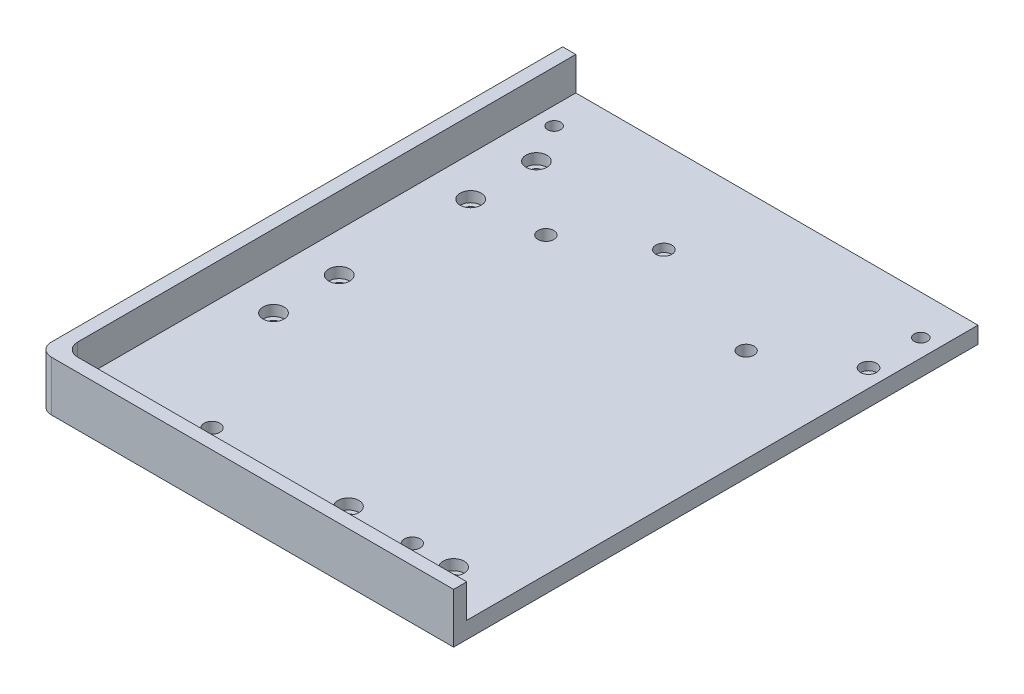
ISO-10303-21;
HEADER;
FILE_DESCRIPTION(('STEP AP214'),'2;1');
FILE_NAME('part.step','',(''),(''),'','','');
FILE_SCHEMA(('AUTOMOTIVE_DESIGN { 1 0 10303 214 1 1 1 1 }'));
ENDSEC;
DATA;
#1=APPLICATION_CONTEXT('core data for automotive mechanical design processes');
#2=APPLICATION_PROTOCOL_DEFINITION('international standard','automotive_design',2000,#1);
#3=PRODUCT_CONTEXT('',#1,'mechanical');
#4=PRODUCT('Part','Part','',(#3));
#5=PRODUCT_RELATED_PRODUCT_CATEGORY('part','',(#4));
#6=PRODUCT_DEFINITION_FORMATION('','',#4);
#7=PRODUCT_DEFINITION_CONTEXT('part definition',#1,'design');
#8=PRODUCT_DEFINITION('design','',#6,#7);
#9=PRODUCT_DEFINITION_SHAPE('','',#8);
#10=(LENGTH_UNIT() NAMED_UNIT(*) SI_UNIT(.MILLI.,.METRE.));
#11=(NAMED_UNIT(*) PLANE_ANGLE_UNIT() SI_UNIT($,.RADIAN.));
#12=(NAMED_UNIT(*) SI_UNIT($,.STERADIAN.) SOLID_ANGLE_UNIT());
#13=UNCERTAINTY_MEASURE_WITH_UNIT(LENGTH_MEASURE(1.E-05),#10,'distance_accuracy_value','');
#14=(GEOMETRIC_REPRESENTATION_CONTEXT(3) GLOBAL_UNCERTAINTY_ASSIGNED_CONTEXT((#13)) GLOBAL_UNIT_ASSIGNED_CONTEXT((#10,
#11,#12)) REPRESENTATION_CONTEXT('',''));
#15=CARTESIAN_POINT('',(0.,0.,0.));
#16=DIRECTION('',(0.,0.,1.));
#17=DIRECTION('',(1.,0.,0.));
#18=AXIS2_PLACEMENT_3D('',#15,#16,#17);
#19=CARTESIAN_POINT('',(0.,6.35,0.));
#20=DIRECTION('',(1.,0.,0.));
#21=DIRECTION('',(0.,0.,-1.));
#22=AXIS2_PLACEMENT_3D('',#19,#20,#21);
#23=PLANE('',#22);
#24=DIRECTION('',(0.,0.,1.));
#25=VECTOR('',#24,1.);
#26=CARTESIAN_POINT('',(0.,0.,0.));
#27=LINE('',#26,#25);
#28=CARTESIAN_POINT('',(0.,0.,0.));
#29=VERTEX_POINT('',#28);
#30=CARTESIAN_POINT('',(0.,0.,194.5));
#31=VERTEX_POINT('',#30);
#32=EDGE_CURVE('E172',#29,#31,#27,.T.);
#33=ORIENTED_EDGE('',*,*,#32,.T.);
#34=DIRECTION('',(0.,-1.,0.));
#35=VECTOR('',#34,1.);
#36=CARTESIAN_POINT('',(0.,6.35,194.5));
#37=LINE('',#36,#35);
#38=CARTESIAN_POINT('',(0.,19.05,194.5));
#39=VERTEX_POINT('',#38);
#40=EDGE_CURVE('E62',#31,#39,#37,.F.);
#41=ORIENTED_EDGE('',*,*,#40,.T.);
#42=DIRECTION('',(0.,0.,1.));
#43=VECTOR('',#42,1.);
#44=CARTESIAN_POINT('',(0.,19.05,0.));
#45=LINE('',#44,#43);
#46=CARTESIAN_POINT('',(0.,19.05,0.));
#47=VERTEX_POINT('',#46);
#48=EDGE_CURVE('E131',#47,#39,#45,.T.);
#49=ORIENTED_EDGE('',*,*,#48,.F.);
#50=DIRECTION('',(0.,-1.,0.));
#51=VECTOR('',#50,1.);
#52=CARTESIAN_POINT('',(0.,6.35,0.));
#53=LINE('',#52,#51);
#54=EDGE_CURVE('E119',#47,#29,#53,.T.);
#55=ORIENTED_EDGE('',*,*,#54,.T.);
#56=EDGE_LOOP('',(#33,#41,#49,#55));
#57=FACE_BOUND('',#56,.T.);
#58=ADVANCED_FACE('F46',(#57),#23,.F.);
#59=CARTESIAN_POINT('',(0.,6.35,199.5));
#60=DIRECTION('',(0.,0.,-1.));
#61=DIRECTION('',(-1.,0.,0.));
#62=AXIS2_PLACEMENT_3D('',#59,#60,#61);
#63=PLANE('',#62);
#64=DIRECTION('',(1.,0.,0.));
#65=VECTOR('',#64,1.);
#66=CARTESIAN_POINT('',(0.,19.05,199.5));
#67=LINE('',#66,#65);
#68=CARTESIAN_POINT('',(5.00000000000005,19.05,199.5));
#69=VERTEX_POINT('',#68);
#70=CARTESIAN_POINT('',(158.,19.05,199.5));
#71=VERTEX_POINT('',#70);
#72=EDGE_CURVE('E135',#69,#71,#67,.T.);
#73=ORIENTED_EDGE('',*,*,#72,.F.);
#74=DIRECTION('',(0.,-1.,0.));
#75=VECTOR('',#74,1.);
#76=CARTESIAN_POINT('',(5.00000000000005,6.35,199.5));
#77=LINE('',#76,#75);
#78=CARTESIAN_POINT('',(5.00000000000005,0.,199.5));
#79=VERTEX_POINT('',#78);
#80=EDGE_CURVE('E205',#69,#79,#77,.T.);
#81=ORIENTED_EDGE('',*,*,#80,.T.);
#82=DIRECTION('',(1.,0.,0.));
#83=VECTOR('',#82,1.);
#84=CARTESIAN_POINT('',(0.,0.,199.5));
#85=LINE('',#84,#83);
#86=CARTESIAN_POINT('',(158.,0.,199.5));
#87=VERTEX_POINT('',#86);
#88=EDGE_CURVE('E181',#79,#87,#85,.T.);
#89=ORIENTED_EDGE('',*,*,#88,.T.);
#90=DIRECTION('',(0.,-1.,0.));
#91=VECTOR('',#90,1.);
#92=CARTESIAN_POINT('',(158.,6.35,199.5));
#93=LINE('',#92,#91);
#94=EDGE_CURVE('E191',#71,#87,#93,.T.);
#95=ORIENTED_EDGE('',*,*,#94,.F.);
#96=EDGE_LOOP('',(#73,#81,#89,#95));
#97=FACE_BOUND('',#96,.T.);
#98=ADVANCED_FACE('F218',(#97),#63,.F.);
#99=CARTESIAN_POINT('',(158.,6.35,0.));
#100=DIRECTION('',(-1.,0.,0.));
#101=DIRECTION('',(0.,0.,1.));
#102=AXIS2_PLACEMENT_3D('',#99,#100,#101);
#103=PLANE('',#102);
#104=DIRECTION('',(0.,0.,-1.));
#105=VECTOR('',#104,1.);
#106=CARTESIAN_POINT('',(158.,0.,0.));
#107=LINE('',#106,#105);
#108=CARTESIAN_POINT('',(158.,0.,0.));
#109=VERTEX_POINT('',#108);
#110=EDGE_CURVE('E184',#87,#109,#107,.T.);
#111=ORIENTED_EDGE('',*,*,#110,.T.);
#112=DIRECTION('',(0.,-1.,0.));
#113=VECTOR('',#112,1.);
#114=CARTESIAN_POINT('',(158.,6.35,0.));
#115=LINE('',#114,#113);
#116=CARTESIAN_POINT('',(158.,6.35,0.));
#117=VERTEX_POINT('',#116);
#118=EDGE_CURVE('E128',#117,#109,#115,.T.);
#119=ORIENTED_EDGE('',*,*,#118,.F.);
#120=DIRECTION('',(0.,0.,-1.));
#121=VECTOR('',#120,1.);
#122=CARTESIAN_POINT('',(158.,6.35,0.));
#123=LINE('',#122,#121);
#124=CARTESIAN_POINT('',(158.,6.35,194.5));
#125=VERTEX_POINT('',#124);
#126=EDGE_CURVE('E173',#125,#117,#123,.T.);
#127=ORIENTED_EDGE('',*,*,#126,.F.);
#128=DIRECTION('',(0.,-1.,0.));
#129=VECTOR('',#128,1.);
#130=CARTESIAN_POINT('',(158.,19.05,194.5));
#131=LINE('',#130,#129);
#132=CARTESIAN_POINT('',(158.,19.05,194.5));
#133=VERTEX_POINT('',#132);
#134=EDGE_CURVE('E168',#133,#125,#131,.T.);
#135=ORIENTED_EDGE('',*,*,#134,.F.);
#136=DIRECTION('',(0.,0.,-1.));
#137=VECTOR('',#136,1.);
#138=CARTESIAN_POINT('',(158.,19.05,199.5));
#139=LINE('',#138,#137);
#140=EDGE_CURVE('E153',#71,#133,#139,.T.);
#141=ORIENTED_EDGE('',*,*,#140,.F.);
#142=ORIENTED_EDGE('',*,*,#94,.T.);
#143=EDGE_LOOP('',(#111,#119,#127,#135,#141,#142));
#144=FACE_BOUND('',#143,.T.);
#145=ADVANCED_FACE('F238',(#144),#103,.F.);
#146=CARTESIAN_POINT('',(0.,6.35,0.));
#147=DIRECTION('',(0.,0.,1.));
#148=DIRECTION('',(1.,0.,0.));
#149=AXIS2_PLACEMENT_3D('',#146,#147,#148);
#150=PLANE('',#149);
#151=DIRECTION('',(-1.,0.,0.));
#152=VECTOR('',#151,1.);
#153=CARTESIAN_POINT('',(0.,0.,0.));
#154=LINE('',#153,#152);
#155=EDGE_CURVE('E126',#109,#29,#154,.T.);
#156=ORIENTED_EDGE('',*,*,#155,.T.);
#157=ORIENTED_EDGE('',*,*,#54,.F.);
#158=DIRECTION('',(-1.,0.,0.));
#159=VECTOR('',#158,1.);
#160=CARTESIAN_POINT('',(0.,19.05,0.));
#161=LINE('',#160,#159);
#162=CARTESIAN_POINT('',(5.,19.05,0.));
#163=VERTEX_POINT('',#162);
#164=EDGE_CURVE('E123',#163,#47,#161,.T.);
#165=ORIENTED_EDGE('',*,*,#164,.F.);
#166=DIRECTION('',(0.,-1.,0.));
#167=VECTOR('',#166,1.);
#168=CARTESIAN_POINT('',(5.,19.05,0.));
#169=LINE('',#168,#167);
#170=CARTESIAN_POINT('',(5.,6.35,0.));
#171=VERTEX_POINT('',#170);
#172=EDGE_CURVE('E162',#163,#171,#169,.T.);
#173=ORIENTED_EDGE('',*,*,#172,.T.);
#174=DIRECTION('',(-1.,0.,0.));
#175=VECTOR('',#174,1.);
#176=CARTESIAN_POINT('',(0.,6.35,0.));
#177=LINE('',#176,#175);
#178=EDGE_CURVE('E129',#117,#171,#177,.T.);
#179=ORIENTED_EDGE('',*,*,#178,.F.);
#180=ORIENTED_EDGE('',*,*,#118,.T.);
#181=EDGE_LOOP('',(#156,#157,#165,#173,#179,#180));
#182=FACE_BOUND('',#181,.T.);
#183=ADVANCED_FACE('F120',(#182),#150,.F.);
#184=CARTESIAN_POINT('',(0.,6.35,0.));
#185=DIRECTION('',(0.,1.,0.));
#186=DIRECTION('',(0.,0.,1.));
#187=AXIS2_PLACEMENT_3D('',#184,#185,#186);
#188=PLANE('',#187);
#189=CARTESIAN_POINT('',(151.25,6.35,34.9));
#190=DIRECTION('',(0.,1.,0.));
#191=DIRECTION('',(0.,0.,1.));
#192=AXIS2_PLACEMENT_3D('',#189,#190,#191);
#193=CIRCLE('',#192,3.04999999999999);
#194=CARTESIAN_POINT('',(151.25,6.35,37.95));
#195=VERTEX_POINT('',#194);
#196=EDGE_CURVE('E375',#195,#195,#193,.T.);
#197=ORIENTED_EDGE('',*,*,#196,.F.);
#198=EDGE_LOOP('',(#197));
#199=FACE_BOUND('',#198,.T.);
#200=CARTESIAN_POINT('',(73.375,6.35,34.9));
#201=DIRECTION('',(0.,1.,0.));
#202=DIRECTION('',(0.,0.,1.));
#203=AXIS2_PLACEMENT_3D('',#200,#201,#202);
#204=CIRCLE('',#203,3.04999999999999);
#205=CARTESIAN_POINT('',(73.375,6.35,37.95));
#206=VERTEX_POINT('',#205);
#207=EDGE_CURVE('E383',#206,#206,#204,.T.);
#208=ORIENTED_EDGE('',*,*,#207,.F.);
#209=EDGE_LOOP('',(#208));
#210=FACE_BOUND('',#209,.T.);
#211=CARTESIAN_POINT('',(11.75,6.35,15.));
#212=DIRECTION('',(0.,1.,0.));
#213=DIRECTION('',(0.,0.,1.));
#214=AXIS2_PLACEMENT_3D('',#211,#212,#213);
#215=CIRCLE('',#214,2.5);
#216=CARTESIAN_POINT('',(11.75,6.35,17.5));
#217=VERTEX_POINT('',#216);
#218=EDGE_CURVE('E398',#217,#217,#215,.T.);
#219=ORIENTED_EDGE('',*,*,#218,.F.);
#220=EDGE_LOOP('',(#219));
#221=FACE_BOUND('',#220,.T.);
#222=CARTESIAN_POINT('',(151.25,6.35,15.));
#223=DIRECTION('',(0.,1.,0.));
#224=DIRECTION('',(0.,0.,1.));
#225=AXIS2_PLACEMENT_3D('',#222,#223,#224);
#226=CIRCLE('',#225,2.5);
#227=CARTESIAN_POINT('',(151.25,6.35,17.5));
#228=VERTEX_POINT('',#227);
#229=EDGE_CURVE('E380',#228,#228,#226,.T.);
#230=ORIENTED_EDGE('',*,*,#229,.F.);
#231=EDGE_LOOP('',(#230));
#232=FACE_BOUND('',#231,.T.);
#233=CARTESIAN_POINT('',(46.1,6.35,179.5));
#234=DIRECTION('',(0.,1.,0.));
#235=DIRECTION('',(0.,0.,1.));
#236=AXIS2_PLACEMENT_3D('',#233,#234,#235);
#237=CIRCLE('',#236,3.00000000000001);
#238=CARTESIAN_POINT('',(46.1,6.35,182.5));
#239=VERTEX_POINT('',#238);
#240=EDGE_CURVE('E422',#239,#239,#237,.T.);
#241=ORIENTED_EDGE('',*,*,#240,.F.);
#242=EDGE_LOOP('',(#241));
#243=FACE_BOUND('',#242,.T.);
#244=CARTESIAN_POINT('',(122.3,6.35,179.5));
#245=DIRECTION('',(0.,1.,0.));
#246=DIRECTION('',(0.,0.,1.));
#247=AXIS2_PLACEMENT_3D('',#244,#245,#246);
#248=CIRCLE('',#247,2.99999999999991);
#249=CARTESIAN_POINT('',(122.3,6.35,182.5));
#250=VERTEX_POINT('',#249);
#251=EDGE_CURVE('E414',#250,#250,#248,.T.);
#252=ORIENTED_EDGE('',*,*,#251,.F.);
#253=EDGE_LOOP('',(#252));
#254=FACE_BOUND('',#253,.T.);
#255=CARTESIAN_POINT('',(122.3,6.35,52.5));
#256=DIRECTION('',(0.,1.,0.));
#257=DIRECTION('',(0.,0.,1.));
#258=AXIS2_PLACEMENT_3D('',#255,#256,#257);
#259=CIRCLE('',#258,2.99999999999991);
#260=CARTESIAN_POINT('',(122.3,6.35,55.4999999999999));
#261=VERTEX_POINT('',#260);
#262=EDGE_CURVE('E405',#261,#261,#259,.T.);
#263=ORIENTED_EDGE('',*,*,#262,.F.);
#264=EDGE_LOOP('',(#263));
#265=FACE_BOUND('',#264,.T.);
#266=CARTESIAN_POINT('',(46.1,6.35,52.5));
#267=DIRECTION('',(0.,1.,0.));
#268=DIRECTION('',(0.,0.,1.));
#269=AXIS2_PLACEMENT_3D('',#266,#267,#268);
#270=CIRCLE('',#269,3.00000000000001);
#271=CARTESIAN_POINT('',(46.1,6.35,55.5));
#272=VERTEX_POINT('',#271);
#273=EDGE_CURVE('E409',#272,#272,#270,.T.);
#274=ORIENTED_EDGE('',*,*,#273,.F.);
#275=EDGE_LOOP('',(#274));
#276=FACE_BOUND('',#275,.T.);
#277=CARTESIAN_POINT('',(98.,6.35,179.5));
#278=DIRECTION('',(0.,1.,0.));
#279=DIRECTION('',(0.,0.,1.));
#280=AXIS2_PLACEMENT_3D('',#277,#278,#279);
#281=CIRCLE('',#280,4.);
#282=CARTESIAN_POINT('',(98.,6.35,183.5));
#283=VERTEX_POINT('',#282);
#284=EDGE_CURVE('E433',#283,#283,#281,.T.);
#285=ORIENTED_EDGE('',*,*,#284,.F.);
#286=EDGE_LOOP('',(#285));
#287=FACE_BOUND('',#286,.T.);
#288=CARTESIAN_POINT('',(138.,6.35,179.5));
#289=DIRECTION('',(0.,1.,0.));
#290=DIRECTION('',(0.,0.,1.));
#291=AXIS2_PLACEMENT_3D('',#288,#289,#290);
#292=CIRCLE('',#291,4.);
#293=CARTESIAN_POINT('',(138.,6.35,183.5));
#294=VERTEX_POINT('',#293);
#295=EDGE_CURVE('E452',#294,#294,#292,.T.);
#296=ORIENTED_EDGE('',*,*,#295,.F.);
#297=EDGE_LOOP('',(#296));
#298=FACE_BOUND('',#297,.T.);
#299=CARTESIAN_POINT('',(20.,6.35,130.));
#300=DIRECTION('',(0.,1.,0.));
#301=DIRECTION('',(0.,0.,1.));
#302=AXIS2_PLACEMENT_3D('',#299,#300,#301);
#303=CIRCLE('',#302,4.);
#304=CARTESIAN_POINT('',(20.,6.35,134.));
#305=VERTEX_POINT('',#304);
#306=EDGE_CURVE('E468',#305,#305,#303,.T.);
#307=ORIENTED_EDGE('',*,*,#306,.F.);
#308=EDGE_LOOP('',(#307));
#309=FACE_BOUND('',#308,.T.);
#310=CARTESIAN_POINT('',(20.,6.35,105.));
#311=DIRECTION('',(0.,1.,0.));
#312=DIRECTION('',(0.,0.,1.));
#313=AXIS2_PLACEMENT_3D('',#310,#311,#312);
#314=CIRCLE('',#313,4.);
#315=CARTESIAN_POINT('',(20.,6.35,109.));
#316=VERTEX_POINT('',#315);
#317=EDGE_CURVE('E484',#316,#316,#314,.T.);
#318=ORIENTED_EDGE('',*,*,#317,.F.);
#319=EDGE_LOOP('',(#318));
#320=FACE_BOUND('',#319,.T.);
#321=CARTESIAN_POINT('',(20.,6.35,30.));
#322=DIRECTION('',(0.,1.,0.));
#323=DIRECTION('',(0.,0.,1.));
#324=AXIS2_PLACEMENT_3D('',#321,#322,#323);
#325=CIRCLE('',#324,4.);
#326=CARTESIAN_POINT('',(20.,6.35,34.));
#327=VERTEX_POINT('',#326);
#328=EDGE_CURVE('E500',#327,#327,#325,.T.);
#329=ORIENTED_EDGE('',*,*,#328,.F.);
#330=EDGE_LOOP('',(#329));
#331=FACE_BOUND('',#330,.T.);
#332=CARTESIAN_POINT('',(20.,6.35,55.));
#333=DIRECTION('',(0.,1.,0.));
#334=DIRECTION('',(0.,0.,1.));
#335=AXIS2_PLACEMENT_3D('',#332,#333,#334);
#336=CIRCLE('',#335,4.);
#337=CARTESIAN_POINT('',(20.,6.35,59.));
#338=VERTEX_POINT('',#337);
#339=EDGE_CURVE('E516',#338,#338,#336,.T.);
#340=ORIENTED_EDGE('',*,*,#339,.F.);
#341=EDGE_LOOP('',(#340));
#342=FACE_BOUND('',#341,.T.);
#343=DIRECTION('',(0.,0.,-1.));
#344=VECTOR('',#343,1.);
#345=CARTESIAN_POINT('',(5.,6.35,0.));
#346=LINE('',#345,#344);
#347=CARTESIAN_POINT('',(5.,6.35,189.5));
#348=VERTEX_POINT('',#347);
#349=EDGE_CURVE('E142',#348,#171,#346,.T.);
#350=ORIENTED_EDGE('',*,*,#349,.F.);
#351=CARTESIAN_POINT('',(10.,6.35,189.5));
#352=DIRECTION('',(0.,1.,0.));
#353=DIRECTION('',(0.,0.,1.));
#354=AXIS2_PLACEMENT_3D('',#351,#352,#353);
#355=CIRCLE('',#354,5.);
#356=CARTESIAN_POINT('',(10.,6.35,194.5));
#357=VERTEX_POINT('',#356);
#358=EDGE_CURVE('E199',#348,#357,#355,.T.);
#359=ORIENTED_EDGE('',*,*,#358,.T.);
#360=DIRECTION('',(-1.,0.,0.));
#361=VECTOR('',#360,1.);
#362=CARTESIAN_POINT('',(5.,6.35,194.5));
#363=LINE('',#362,#361);
#364=EDGE_CURVE('E145',#125,#357,#363,.T.);
#365=ORIENTED_EDGE('',*,*,#364,.F.);
#366=ORIENTED_EDGE('',*,*,#126,.T.);
#367=ORIENTED_EDGE('',*,*,#178,.T.);
#368=EDGE_LOOP('',(#350,#359,#365,#366,#367));
#369=FACE_BOUND('',#368,.T.);
#370=ADVANCED_FACE('F246',(#199,#210,#221,#232,#243,#254,#265,#276,#287,#298,#309,#320,#331,
#342,#369),#188,.T.);
#371=CARTESIAN_POINT('',(0.,0.,0.));
#372=DIRECTION('',(0.,1.,0.));
#373=DIRECTION('',(0.,0.,1.));
#374=AXIS2_PLACEMENT_3D('',#371,#372,#373);
#375=PLANE('',#374);
#376=CARTESIAN_POINT('',(11.75,0.,15.));
#377=DIRECTION('',(0.,1.,0.));
#378=DIRECTION('',(0.,0.,1.));
#379=AXIS2_PLACEMENT_3D('',#376,#377,#378);
#380=CIRCLE('',#379,2.5);
#381=CARTESIAN_POINT('',(11.75,0.,17.5));
#382=VERTEX_POINT('',#381);
#383=EDGE_CURVE('E393',#382,#382,#380,.T.);
#384=ORIENTED_EDGE('',*,*,#383,.T.);
#385=EDGE_LOOP('',(#384));
#386=FACE_BOUND('',#385,.T.);
#387=CARTESIAN_POINT('',(151.25,0.,15.));
#388=DIRECTION('',(0.,1.,0.));
#389=DIRECTION('',(0.,0.,1.));
#390=AXIS2_PLACEMENT_3D('',#387,#388,#389);
#391=CIRCLE('',#390,2.5);
#392=CARTESIAN_POINT('',(151.25,0.,17.5));
#393=VERTEX_POINT('',#392);
#394=EDGE_CURVE('E374',#393,#393,#391,.T.);
#395=ORIENTED_EDGE('',*,*,#394,.T.);
#396=EDGE_LOOP('',(#395));
#397=FACE_BOUND('',#396,.T.);
#398=CARTESIAN_POINT('',(46.1,0.,179.5));
#399=DIRECTION('',(0.,1.,0.));
#400=DIRECTION('',(0.,0.,1.));
#401=AXIS2_PLACEMENT_3D('',#398,#399,#400);
#402=CIRCLE('',#401,3.00000000000001);
#403=CARTESIAN_POINT('',(46.1,0.,182.5));
#404=VERTEX_POINT('',#403);
#405=EDGE_CURVE('E397',#404,#404,#402,.T.);
#406=ORIENTED_EDGE('',*,*,#405,.T.);
#407=EDGE_LOOP('',(#406));
#408=FACE_BOUND('',#407,.T.);
#409=CARTESIAN_POINT('',(122.3,0.,179.5));
#410=DIRECTION('',(0.,1.,0.));
#411=DIRECTION('',(0.,0.,1.));
#412=AXIS2_PLACEMENT_3D('',#409,#410,#411);
#413=CIRCLE('',#412,2.99999999999991);
#414=CARTESIAN_POINT('',(122.3,0.,182.5));
#415=VERTEX_POINT('',#414);
#416=EDGE_CURVE('E418',#415,#415,#413,.T.);
#417=ORIENTED_EDGE('',*,*,#416,.T.);
#418=EDGE_LOOP('',(#417));
#419=FACE_BOUND('',#418,.T.);
#420=CARTESIAN_POINT('',(122.3,0.,52.5));
#421=DIRECTION('',(0.,1.,0.));
#422=DIRECTION('',(0.,0.,1.));
#423=AXIS2_PLACEMENT_3D('',#420,#421,#422);
#424=CIRCLE('',#423,2.99999999999991);
#425=CARTESIAN_POINT('',(122.3,0.,55.4999999999999));
#426=VERTEX_POINT('',#425);
#427=EDGE_CURVE('E410',#426,#426,#424,.T.);
#428=ORIENTED_EDGE('',*,*,#427,.T.);
#429=EDGE_LOOP('',(#428));
#430=FACE_BOUND('',#429,.T.);
#431=CARTESIAN_POINT('',(46.1,0.,52.5));
#432=DIRECTION('',(0.,1.,0.));
#433=DIRECTION('',(0.,0.,1.));
#434=AXIS2_PLACEMENT_3D('',#431,#432,#433);
#435=CIRCLE('',#434,3.00000000000001);
#436=CARTESIAN_POINT('',(46.1,0.,55.5));
#437=VERTEX_POINT('',#436);
#438=EDGE_CURVE('E429',#437,#437,#435,.T.);
#439=ORIENTED_EDGE('',*,*,#438,.T.);
#440=EDGE_LOOP('',(#439));
#441=FACE_BOUND('',#440,.T.);
#442=CARTESIAN_POINT('',(98.,0.,179.5));
#443=DIRECTION('',(0.,1.,0.));
#444=DIRECTION('',(0.,0.,1.));
#445=AXIS2_PLACEMENT_3D('',#442,#443,#444);
#446=CIRCLE('',#445,2.25);
#447=CARTESIAN_POINT('',(98.,0.,181.75));
#448=VERTEX_POINT('',#447);
#449=EDGE_CURVE('E448',#448,#448,#446,.T.);
#450=ORIENTED_EDGE('',*,*,#449,.T.);
#451=EDGE_LOOP('',(#450));
#452=FACE_BOUND('',#451,.T.);
#453=CARTESIAN_POINT('',(138.,0.,179.5));
#454=DIRECTION('',(0.,1.,0.));
#455=DIRECTION('',(0.,0.,1.));
#456=AXIS2_PLACEMENT_3D('',#453,#454,#455);
#457=CIRCLE('',#456,2.25);
#458=CARTESIAN_POINT('',(138.,0.,181.75));
#459=VERTEX_POINT('',#458);
#460=EDGE_CURVE('E464',#459,#459,#457,.T.);
#461=ORIENTED_EDGE('',*,*,#460,.T.);
#462=EDGE_LOOP('',(#461));
#463=FACE_BOUND('',#462,.T.);
#464=CARTESIAN_POINT('',(20.,0.,130.));
#465=DIRECTION('',(0.,1.,0.));
#466=DIRECTION('',(0.,0.,1.));
#467=AXIS2_PLACEMENT_3D('',#464,#465,#466);
#468=CIRCLE('',#467,2.25);
#469=CARTESIAN_POINT('',(20.,0.,132.25));
#470=VERTEX_POINT('',#469);
#471=EDGE_CURVE('E480',#470,#470,#468,.T.);
#472=ORIENTED_EDGE('',*,*,#471,.T.);
#473=EDGE_LOOP('',(#472));
#474=FACE_BOUND('',#473,.T.);
#475=CARTESIAN_POINT('',(20.,0.,105.));
#476=DIRECTION('',(0.,1.,0.));
#477=DIRECTION('',(0.,0.,1.));
#478=AXIS2_PLACEMENT_3D('',#475,#476,#477);
#479=CIRCLE('',#478,2.25);
#480=CARTESIAN_POINT('',(20.,0.,107.25));
#481=VERTEX_POINT('',#480);
#482=EDGE_CURVE('E496',#481,#481,#479,.T.);
#483=ORIENTED_EDGE('',*,*,#482,.T.);
#484=EDGE_LOOP('',(#483));
#485=FACE_BOUND('',#484,.T.);
#486=CARTESIAN_POINT('',(20.,0.,30.));
#487=DIRECTION('',(0.,1.,0.));
#488=DIRECTION('',(0.,0.,1.));
#489=AXIS2_PLACEMENT_3D('',#486,#487,#488);
#490=CIRCLE('',#489,2.25);
#491=CARTESIAN_POINT('',(20.,0.,32.25));
#492=VERTEX_POINT('',#491);
#493=EDGE_CURVE('E512',#492,#492,#490,.T.);
#494=ORIENTED_EDGE('',*,*,#493,.T.);
#495=EDGE_LOOP('',(#494));
#496=FACE_BOUND('',#495,.T.);
#497=CARTESIAN_POINT('',(20.,0.,55.));
#498=DIRECTION('',(0.,1.,0.));
#499=DIRECTION('',(0.,0.,1.));
#500=AXIS2_PLACEMENT_3D('',#497,#498,#499);
#501=CIRCLE('',#500,2.25);
#502=CARTESIAN_POINT('',(20.,0.,57.25));
#503=VERTEX_POINT('',#502);
#504=EDGE_CURVE('E148',#503,#503,#501,.T.);
#505=ORIENTED_EDGE('',*,*,#504,.T.);
#506=EDGE_LOOP('',(#505));
#507=FACE_BOUND('',#506,.T.);
#508=ORIENTED_EDGE('',*,*,#88,.F.);
#509=CARTESIAN_POINT('',(5.00000000000005,0.,194.5));
#510=DIRECTION('',(0.,1.,0.));
#511=DIRECTION('',(0.,0.,1.));
#512=AXIS2_PLACEMENT_3D('',#509,#510,#511);
#513=CIRCLE('',#512,5.);
#514=EDGE_CURVE('E70',#79,#31,#513,.F.);
#515=ORIENTED_EDGE('',*,*,#514,.T.);
#516=ORIENTED_EDGE('',*,*,#32,.F.);
#517=ORIENTED_EDGE('',*,*,#155,.F.);
#518=ORIENTED_EDGE('',*,*,#110,.F.);
#519=EDGE_LOOP('',(#508,#515,#516,#517,#518));
#520=FACE_BOUND('',#519,.T.);
#521=ADVANCED_FACE('F247',(#386,#397,#408,#419,#430,#441,#452,#463,#474,#485,#496,#507,#520),
#375,.F.);
#522=CARTESIAN_POINT('',(5.,19.05,194.5));
#523=DIRECTION('',(0.,0.,1.));
#524=DIRECTION('',(1.,0.,0.));
#525=AXIS2_PLACEMENT_3D('',#522,#523,#524);
#526=PLANE('',#525);
#527=ORIENTED_EDGE('',*,*,#364,.T.);
#528=DIRECTION('',(0.,-1.,0.));
#529=VECTOR('',#528,1.);
#530=CARTESIAN_POINT('',(10.,19.05,194.5));
#531=LINE('',#530,#529);
#532=CARTESIAN_POINT('',(10.,19.05,194.5));
#533=VERTEX_POINT('',#532);
#534=EDGE_CURVE('E202',#357,#533,#531,.F.);
#535=ORIENTED_EDGE('',*,*,#534,.T.);
#536=DIRECTION('',(-1.,0.,0.));
#537=VECTOR('',#536,1.);
#538=CARTESIAN_POINT('',(5.,19.05,194.5));
#539=LINE('',#538,#537);
#540=EDGE_CURVE('E156',#133,#533,#539,.T.);
#541=ORIENTED_EDGE('',*,*,#540,.F.);
#542=ORIENTED_EDGE('',*,*,#134,.T.);
#543=EDGE_LOOP('',(#527,#535,#541,#542));
#544=FACE_BOUND('',#543,.T.);
#545=ADVANCED_FACE('F250',(#544),#526,.F.);
#546=CARTESIAN_POINT('',(5.,19.05,0.));
#547=DIRECTION('',(-1.,0.,0.));
#548=DIRECTION('',(0.,0.,1.));
#549=AXIS2_PLACEMENT_3D('',#546,#547,#548);
#550=PLANE('',#549);
#551=DIRECTION('',(0.,0.,-1.));
#552=VECTOR('',#551,1.);
#553=CARTESIAN_POINT('',(5.,19.05,0.));
#554=LINE('',#553,#552);
#555=CARTESIAN_POINT('',(5.,19.05,189.5));
#556=VERTEX_POINT('',#555);
#557=EDGE_CURVE('E139',#556,#163,#554,.T.);
#558=ORIENTED_EDGE('',*,*,#557,.F.);
#559=DIRECTION('',(0.,-1.,0.));
#560=VECTOR('',#559,1.);
#561=CARTESIAN_POINT('',(5.,6.35,189.5));
#562=LINE('',#561,#560);
#563=EDGE_CURVE('E195',#556,#348,#562,.T.);
#564=ORIENTED_EDGE('',*,*,#563,.T.);
#565=ORIENTED_EDGE('',*,*,#349,.T.);
#566=ORIENTED_EDGE('',*,*,#172,.F.);
#567=EDGE_LOOP('',(#558,#564,#565,#566));
#568=FACE_BOUND('',#567,.T.);
#569=ADVANCED_FACE('F257',(#568),#550,.F.);
#570=CARTESIAN_POINT('',(0.,19.05,0.));
#571=DIRECTION('',(0.,-1.,0.));
#572=DIRECTION('',(0.,0.,-1.));
#573=AXIS2_PLACEMENT_3D('',#570,#571,#572);
#574=PLANE('',#573);
#575=ORIENTED_EDGE('',*,*,#48,.T.);
#576=CARTESIAN_POINT('',(5.00000000000005,19.05,194.5));
#577=DIRECTION('',(0.,-1.,0.));
#578=DIRECTION('',(0.,0.,-1.));
#579=AXIS2_PLACEMENT_3D('',#576,#577,#578);
#580=CIRCLE('',#579,5.);
#581=EDGE_CURVE('E55',#39,#69,#580,.F.);
#582=ORIENTED_EDGE('',*,*,#581,.T.);
#583=ORIENTED_EDGE('',*,*,#72,.T.);
#584=ORIENTED_EDGE('',*,*,#140,.T.);
#585=ORIENTED_EDGE('',*,*,#540,.T.);
#586=CARTESIAN_POINT('',(10.,19.05,189.5));
#587=DIRECTION('',(0.,-1.,0.));
#588=DIRECTION('',(0.,0.,-1.));
#589=AXIS2_PLACEMENT_3D('',#586,#587,#588);
#590=CIRCLE('',#589,5.);
#591=EDGE_CURVE('E11',#533,#556,#590,.T.);
#592=ORIENTED_EDGE('',*,*,#591,.T.);
#593=ORIENTED_EDGE('',*,*,#557,.T.);
#594=ORIENTED_EDGE('',*,*,#164,.T.);
#595=EDGE_LOOP('',(#575,#582,#583,#584,#585,#592,#593,#594));
#596=FACE_BOUND('',#595,.T.);
#597=ADVANCED_FACE('F137',(#596),#574,.F.);
#598=CARTESIAN_POINT('',(20.,6.35,55.));
#599=DIRECTION('',(0.,1.,0.));
#600=DIRECTION('',(0.,0.,1.));
#601=AXIS2_PLACEMENT_3D('',#598,#599,#600);
#602=CYLINDRICAL_SURFACE('',#601,2.25);
#603=ORIENTED_EDGE('',*,*,#504,.F.);
#604=EDGE_LOOP('',(#603));
#605=FACE_BOUND('',#604,.T.);
#606=CARTESIAN_POINT('',(20.,2.35,55.));
#607=DIRECTION('',(0.,1.,0.));
#608=DIRECTION('',(0.,0.,1.));
#609=AXIS2_PLACEMENT_3D('',#606,#607,#608);
#610=CIRCLE('',#609,2.25);
#611=CARTESIAN_POINT('',(20.,2.35,57.25));
#612=VERTEX_POINT('',#611);
#613=EDGE_CURVE('E523',#612,#612,#610,.T.);
#614=ORIENTED_EDGE('',*,*,#613,.T.);
#615=EDGE_LOOP('',(#614));
#616=FACE_BOUND('',#615,.T.);
#617=ADVANCED_FACE('F264',(#605,#616),#602,.F.);
#618=CARTESIAN_POINT('',(22.25,2.35,55.));
#619=DIRECTION('',(0.,-1.,0.));
#620=DIRECTION('',(0.,0.,-1.));
#621=AXIS2_PLACEMENT_3D('',#618,#619,#620);
#622=PLANE('',#621);
#623=ORIENTED_EDGE('',*,*,#613,.F.);
#624=EDGE_LOOP('',(#623));
#625=FACE_BOUND('',#624,.T.);
#626=CARTESIAN_POINT('',(20.,2.35,55.));
#627=DIRECTION('',(0.,1.,0.));
#628=DIRECTION('',(0.,0.,1.));
#629=AXIS2_PLACEMENT_3D('',#626,#627,#628);
#630=CIRCLE('',#629,4.);
#631=CARTESIAN_POINT('',(20.,2.35,59.));
#632=VERTEX_POINT('',#631);
#633=EDGE_CURVE('E520',#632,#632,#630,.T.);
#634=ORIENTED_EDGE('',*,*,#633,.T.);
#635=EDGE_LOOP('',(#634));
#636=FACE_BOUND('',#635,.T.);
#637=ADVANCED_FACE('F267',(#625,#636),#622,.F.);
#638=CARTESIAN_POINT('',(20.,6.35,55.));
#639=DIRECTION('',(0.,1.,0.));
#640=DIRECTION('',(0.,0.,1.));
#641=AXIS2_PLACEMENT_3D('',#638,#639,#640);
#642=CYLINDRICAL_SURFACE('',#641,4.);
#643=ORIENTED_EDGE('',*,*,#633,.F.);
#644=EDGE_LOOP('',(#643));
#645=FACE_BOUND('',#644,.T.);
#646=ORIENTED_EDGE('',*,*,#339,.T.);
#647=EDGE_LOOP('',(#646));
#648=FACE_BOUND('',#647,.T.);
#649=ADVANCED_FACE('F271',(#645,#648),#642,.F.);
#650=CARTESIAN_POINT('',(20.,6.35,30.));
#651=DIRECTION('',(0.,1.,0.));
#652=DIRECTION('',(0.,0.,1.));
#653=AXIS2_PLACEMENT_3D('',#650,#651,#652);
#654=CYLINDRICAL_SURFACE('',#653,2.25);
#655=ORIENTED_EDGE('',*,*,#493,.F.);
#656=EDGE_LOOP('',(#655));
#657=FACE_BOUND('',#656,.T.);
#658=CARTESIAN_POINT('',(20.,2.35,30.));
#659=DIRECTION('',(0.,1.,0.));
#660=DIRECTION('',(0.,0.,1.));
#661=AXIS2_PLACEMENT_3D('',#658,#659,#660);
#662=CIRCLE('',#661,2.25);
#663=CARTESIAN_POINT('',(20.,2.35,32.25));
#664=VERTEX_POINT('',#663);
#665=EDGE_CURVE('E508',#664,#664,#662,.T.);
#666=ORIENTED_EDGE('',*,*,#665,.T.);
#667=EDGE_LOOP('',(#666));
#668=FACE_BOUND('',#667,.T.);
#669=ADVANCED_FACE('F275',(#657,#668),#654,.F.);
#670=CARTESIAN_POINT('',(22.25,2.35,30.));
#671=DIRECTION('',(0.,-1.,0.));
#672=DIRECTION('',(0.,0.,-1.));
#673=AXIS2_PLACEMENT_3D('',#670,#671,#672);
#674=PLANE('',#673);
#675=ORIENTED_EDGE('',*,*,#665,.F.);
#676=EDGE_LOOP('',(#675));
#677=FACE_BOUND('',#676,.T.);
#678=CARTESIAN_POINT('',(20.,2.35,30.));
#679=DIRECTION('',(0.,1.,0.));
#680=DIRECTION('',(0.,0.,1.));
#681=AXIS2_PLACEMENT_3D('',#678,#679,#680);
#682=CIRCLE('',#681,4.);
#683=CARTESIAN_POINT('',(20.,2.35,34.));
#684=VERTEX_POINT('',#683);
#685=EDGE_CURVE('E504',#684,#684,#682,.T.);
#686=ORIENTED_EDGE('',*,*,#685,.T.);
#687=EDGE_LOOP('',(#686));
#688=FACE_BOUND('',#687,.T.);
#689=ADVANCED_FACE('F279',(#677,#688),#674,.F.);
#690=CARTESIAN_POINT('',(20.,6.35,30.));
#691=DIRECTION('',(0.,1.,0.));
#692=DIRECTION('',(0.,0.,1.));
#693=AXIS2_PLACEMENT_3D('',#690,#691,#692);
#694=CYLINDRICAL_SURFACE('',#693,4.);
#695=ORIENTED_EDGE('',*,*,#685,.F.);
#696=EDGE_LOOP('',(#695));
#697=FACE_BOUND('',#696,.T.);
#698=ORIENTED_EDGE('',*,*,#328,.T.);
#699=EDGE_LOOP('',(#698));
#700=FACE_BOUND('',#699,.T.);
#701=ADVANCED_FACE('F283',(#697,#700),#694,.F.);
#702=CARTESIAN_POINT('',(20.,6.35,105.));
#703=DIRECTION('',(0.,1.,0.));
#704=DIRECTION('',(0.,0.,1.));
#705=AXIS2_PLACEMENT_3D('',#702,#703,#704);
#706=CYLINDRICAL_SURFACE('',#705,2.25);
#707=ORIENTED_EDGE('',*,*,#482,.F.);
#708=EDGE_LOOP('',(#707));
#709=FACE_BOUND('',#708,.T.);
#710=CARTESIAN_POINT('',(20.,2.35,105.));
#711=DIRECTION('',(0.,1.,0.));
#712=DIRECTION('',(0.,0.,1.));
#713=AXIS2_PLACEMENT_3D('',#710,#711,#712);
#714=CIRCLE('',#713,2.25);
#715=CARTESIAN_POINT('',(20.,2.35,107.25));
#716=VERTEX_POINT('',#715);
#717=EDGE_CURVE('E492',#716,#716,#714,.T.);
#718=ORIENTED_EDGE('',*,*,#717,.T.);
#719=EDGE_LOOP('',(#718));
#720=FACE_BOUND('',#719,.T.);
#721=ADVANCED_FACE('F287',(#709,#720),#706,.F.);
#722=CARTESIAN_POINT('',(22.25,2.35,105.));
#723=DIRECTION('',(0.,-1.,0.));
#724=DIRECTION('',(0.,0.,-1.));
#725=AXIS2_PLACEMENT_3D('',#722,#723,#724);
#726=PLANE('',#725);
#727=ORIENTED_EDGE('',*,*,#717,.F.);
#728=EDGE_LOOP('',(#727));
#729=FACE_BOUND('',#728,.T.);
#730=CARTESIAN_POINT('',(20.,2.35,105.));
#731=DIRECTION('',(0.,1.,0.));
#732=DIRECTION('',(0.,0.,1.));
#733=AXIS2_PLACEMENT_3D('',#730,#731,#732);
#734=CIRCLE('',#733,4.);
#735=CARTESIAN_POINT('',(20.,2.35,109.));
#736=VERTEX_POINT('',#735);
#737=EDGE_CURVE('E488',#736,#736,#734,.T.);
#738=ORIENTED_EDGE('',*,*,#737,.T.);
#739=EDGE_LOOP('',(#738));
#740=FACE_BOUND('',#739,.T.);
#741=ADVANCED_FACE('F291',(#729,#740),#726,.F.);
#742=CARTESIAN_POINT('',(20.,6.35,105.));
#743=DIRECTION('',(0.,1.,0.));
#744=DIRECTION('',(0.,0.,1.));
#745=AXIS2_PLACEMENT_3D('',#742,#743,#744);
#746=CYLINDRICAL_SURFACE('',#745,4.);
#747=ORIENTED_EDGE('',*,*,#737,.F.);
#748=EDGE_LOOP('',(#747));
#749=FACE_BOUND('',#748,.T.);
#750=ORIENTED_EDGE('',*,*,#317,.T.);
#751=EDGE_LOOP('',(#750));
#752=FACE_BOUND('',#751,.T.);
#753=ADVANCED_FACE('F295',(#749,#752),#746,.F.);
#754=CARTESIAN_POINT('',(20.,6.35,130.));
#755=DIRECTION('',(0.,1.,0.));
#756=DIRECTION('',(0.,0.,1.));
#757=AXIS2_PLACEMENT_3D('',#754,#755,#756);
#758=CYLINDRICAL_SURFACE('',#757,2.25);
#759=ORIENTED_EDGE('',*,*,#471,.F.);
#760=EDGE_LOOP('',(#759));
#761=FACE_BOUND('',#760,.T.);
#762=CARTESIAN_POINT('',(20.,2.35,130.));
#763=DIRECTION('',(0.,1.,0.));
#764=DIRECTION('',(0.,0.,1.));
#765=AXIS2_PLACEMENT_3D('',#762,#763,#764);
#766=CIRCLE('',#765,2.25);
#767=CARTESIAN_POINT('',(20.,2.35,132.25));
#768=VERTEX_POINT('',#767);
#769=EDGE_CURVE('E476',#768,#768,#766,.T.);
#770=ORIENTED_EDGE('',*,*,#769,.T.);
#771=EDGE_LOOP('',(#770));
#772=FACE_BOUND('',#771,.T.);
#773=ADVANCED_FACE('F299',(#761,#772),#758,.F.);
#774=CARTESIAN_POINT('',(22.25,2.35,130.));
#775=DIRECTION('',(0.,-1.,0.));
#776=DIRECTION('',(0.,0.,-1.));
#777=AXIS2_PLACEMENT_3D('',#774,#775,#776);
#778=PLANE('',#777);
#779=ORIENTED_EDGE('',*,*,#769,.F.);
#780=EDGE_LOOP('',(#779));
#781=FACE_BOUND('',#780,.T.);
#782=CARTESIAN_POINT('',(20.,2.35,130.));
#783=DIRECTION('',(0.,1.,0.));
#784=DIRECTION('',(0.,0.,1.));
#785=AXIS2_PLACEMENT_3D('',#782,#783,#784);
#786=CIRCLE('',#785,4.);
#787=CARTESIAN_POINT('',(20.,2.35,134.));
#788=VERTEX_POINT('',#787);
#789=EDGE_CURVE('E472',#788,#788,#786,.T.);
#790=ORIENTED_EDGE('',*,*,#789,.T.);
#791=EDGE_LOOP('',(#790));
#792=FACE_BOUND('',#791,.T.);
#793=ADVANCED_FACE('F303',(#781,#792),#778,.F.);
#794=CARTESIAN_POINT('',(20.,6.35,130.));
#795=DIRECTION('',(0.,1.,0.));
#796=DIRECTION('',(0.,0.,1.));
#797=AXIS2_PLACEMENT_3D('',#794,#795,#796);
#798=CYLINDRICAL_SURFACE('',#797,4.);
#799=ORIENTED_EDGE('',*,*,#789,.F.);
#800=EDGE_LOOP('',(#799));
#801=FACE_BOUND('',#800,.T.);
#802=ORIENTED_EDGE('',*,*,#306,.T.);
#803=EDGE_LOOP('',(#802));
#804=FACE_BOUND('',#803,.T.);
#805=ADVANCED_FACE('F307',(#801,#804),#798,.F.);
#806=CARTESIAN_POINT('',(138.,6.35,179.5));
#807=DIRECTION('',(0.,1.,0.));
#808=DIRECTION('',(0.,0.,1.));
#809=AXIS2_PLACEMENT_3D('',#806,#807,#808);
#810=CYLINDRICAL_SURFACE('',#809,2.25);
#811=ORIENTED_EDGE('',*,*,#460,.F.);
#812=EDGE_LOOP('',(#811));
#813=FACE_BOUND('',#812,.T.);
#814=CARTESIAN_POINT('',(138.,2.35,179.5));
#815=DIRECTION('',(0.,1.,0.));
#816=DIRECTION('',(0.,0.,1.));
#817=AXIS2_PLACEMENT_3D('',#814,#815,#816);
#818=CIRCLE('',#817,2.25);
#819=CARTESIAN_POINT('',(138.,2.35,181.75));
#820=VERTEX_POINT('',#819);
#821=EDGE_CURVE('E460',#820,#820,#818,.T.);
#822=ORIENTED_EDGE('',*,*,#821,.T.);
#823=EDGE_LOOP('',(#822));
#824=FACE_BOUND('',#823,.T.);
#825=ADVANCED_FACE('F311',(#813,#824),#810,.F.);
#826=CARTESIAN_POINT('',(140.25,2.35,179.5));
#827=DIRECTION('',(0.,-1.,0.));
#828=DIRECTION('',(0.,0.,-1.));
#829=AXIS2_PLACEMENT_3D('',#826,#827,#828);
#830=PLANE('',#829);
#831=ORIENTED_EDGE('',*,*,#821,.F.);
#832=EDGE_LOOP('',(#831));
#833=FACE_BOUND('',#832,.T.);
#834=CARTESIAN_POINT('',(138.,2.35,179.5));
#835=DIRECTION('',(0.,1.,0.));
#836=DIRECTION('',(0.,0.,1.));
#837=AXIS2_PLACEMENT_3D('',#834,#835,#836);
#838=CIRCLE('',#837,4.);
#839=CARTESIAN_POINT('',(138.,2.35,183.5));
#840=VERTEX_POINT('',#839);
#841=EDGE_CURVE('E456',#840,#840,#838,.T.);
#842=ORIENTED_EDGE('',*,*,#841,.T.);
#843=EDGE_LOOP('',(#842));
#844=FACE_BOUND('',#843,.T.);
#845=ADVANCED_FACE('F315',(#833,#844),#830,.F.);
#846=CARTESIAN_POINT('',(138.,6.35,179.5));
#847=DIRECTION('',(0.,1.,0.));
#848=DIRECTION('',(0.,0.,1.));
#849=AXIS2_PLACEMENT_3D('',#846,#847,#848);
#850=CYLINDRICAL_SURFACE('',#849,4.);
#851=ORIENTED_EDGE('',*,*,#841,.F.);
#852=EDGE_LOOP('',(#851));
#853=FACE_BOUND('',#852,.T.);
#854=ORIENTED_EDGE('',*,*,#295,.T.);
#855=EDGE_LOOP('',(#854));
#856=FACE_BOUND('',#855,.T.);
#857=ADVANCED_FACE('F319',(#853,#856),#850,.F.);
#858=CARTESIAN_POINT('',(98.,6.35,179.5));
#859=DIRECTION('',(0.,1.,0.));
#860=DIRECTION('',(0.,0.,1.));
#861=AXIS2_PLACEMENT_3D('',#858,#859,#860);
#862=CYLINDRICAL_SURFACE('',#861,2.25);
#863=ORIENTED_EDGE('',*,*,#449,.F.);
#864=EDGE_LOOP('',(#863));
#865=FACE_BOUND('',#864,.T.);
#866=CARTESIAN_POINT('',(98.,2.35,179.5));
#867=DIRECTION('',(0.,1.,0.));
#868=DIRECTION('',(0.,0.,1.));
#869=AXIS2_PLACEMENT_3D('',#866,#867,#868);
#870=CIRCLE('',#869,2.25);
#871=CARTESIAN_POINT('',(98.,2.35,181.75));
#872=VERTEX_POINT('',#871);
#873=EDGE_CURVE('E444',#872,#872,#870,.T.);
#874=ORIENTED_EDGE('',*,*,#873,.T.);
#875=EDGE_LOOP('',(#874));
#876=FACE_BOUND('',#875,.T.);
#877=ADVANCED_FACE('F323',(#865,#876),#862,.F.);
#878=CARTESIAN_POINT('',(100.25,2.35,179.5));
#879=DIRECTION('',(0.,-1.,0.));
#880=DIRECTION('',(0.,0.,-1.));
#881=AXIS2_PLACEMENT_3D('',#878,#879,#880);
#882=PLANE('',#881);
#883=ORIENTED_EDGE('',*,*,#873,.F.);
#884=EDGE_LOOP('',(#883));
#885=FACE_BOUND('',#884,.T.);
#886=CARTESIAN_POINT('',(98.,2.35,179.5));
#887=DIRECTION('',(0.,1.,0.));
#888=DIRECTION('',(0.,0.,1.));
#889=AXIS2_PLACEMENT_3D('',#886,#887,#888);
#890=CIRCLE('',#889,4.);
#891=CARTESIAN_POINT('',(98.,2.35,183.5));
#892=VERTEX_POINT('',#891);
#893=EDGE_CURVE('E440',#892,#892,#890,.T.);
#894=ORIENTED_EDGE('',*,*,#893,.T.);
#895=EDGE_LOOP('',(#894));
#896=FACE_BOUND('',#895,.T.);
#897=ADVANCED_FACE('F327',(#885,#896),#882,.F.);
#898=CARTESIAN_POINT('',(98.,6.35,179.5));
#899=DIRECTION('',(0.,1.,0.));
#900=DIRECTION('',(0.,0.,1.));
#901=AXIS2_PLACEMENT_3D('',#898,#899,#900);
#902=CYLINDRICAL_SURFACE('',#901,4.);
#903=ORIENTED_EDGE('',*,*,#893,.F.);
#904=EDGE_LOOP('',(#903));
#905=FACE_BOUND('',#904,.T.);
#906=ORIENTED_EDGE('',*,*,#284,.T.);
#907=EDGE_LOOP('',(#906));
#908=FACE_BOUND('',#907,.T.);
#909=ADVANCED_FACE('F230',(#905,#908),#902,.F.);
#910=CARTESIAN_POINT('',(10.,19.05,189.5));
#911=DIRECTION('',(0.,1.,0.));
#912=DIRECTION('',(0.,0.,1.));
#913=AXIS2_PLACEMENT_3D('',#910,#911,#912);
#914=CYLINDRICAL_SURFACE('',#913,5.);
#915=ORIENTED_EDGE('',*,*,#591,.F.);
#916=ORIENTED_EDGE('',*,*,#534,.F.);
#917=ORIENTED_EDGE('',*,*,#358,.F.);
#918=ORIENTED_EDGE('',*,*,#563,.F.);
#919=EDGE_LOOP('',(#915,#916,#917,#918));
#920=FACE_BOUND('',#919,.T.);
#921=ADVANCED_FACE('F222',(#920),#914,.F.);
#922=CARTESIAN_POINT('',(5.00000000000005,6.35,194.5));
#923=DIRECTION('',(0.,-1.,0.));
#924=DIRECTION('',(0.,0.,-1.));
#925=AXIS2_PLACEMENT_3D('',#922,#923,#924);
#926=CYLINDRICAL_SURFACE('',#925,5.);
#927=ORIENTED_EDGE('',*,*,#581,.F.);
#928=ORIENTED_EDGE('',*,*,#40,.F.);
#929=ORIENTED_EDGE('',*,*,#514,.F.);
#930=ORIENTED_EDGE('',*,*,#80,.F.);
#931=EDGE_LOOP('',(#927,#928,#929,#930));
#932=FACE_BOUND('',#931,.T.);
#933=ADVANCED_FACE('F48',(#932),#926,.T.);
#934=CARTESIAN_POINT('',(46.1,0.,52.5));
#935=DIRECTION('',(0.,1.,0.));
#936=DIRECTION('',(0.,0.,1.));
#937=AXIS2_PLACEMENT_3D('',#934,#935,#936);
#938=CYLINDRICAL_SURFACE('',#937,3.00000000000001);
#939=ORIENTED_EDGE('',*,*,#438,.F.);
#940=EDGE_LOOP('',(#939));
#941=FACE_BOUND('',#940,.T.);
#942=ORIENTED_EDGE('',*,*,#273,.T.);
#943=EDGE_LOOP('',(#942));
#944=FACE_BOUND('',#943,.T.);
#945=ADVANCED_FACE('F221',(#941,#944),#938,.F.);
#946=CARTESIAN_POINT('',(122.3,0.,52.5));
#947=DIRECTION('',(0.,1.,0.));
#948=DIRECTION('',(0.,0.,1.));
#949=AXIS2_PLACEMENT_3D('',#946,#947,#948);
#950=CYLINDRICAL_SURFACE('',#949,2.99999999999991);
#951=ORIENTED_EDGE('',*,*,#427,.F.);
#952=EDGE_LOOP('',(#951));
#953=FACE_BOUND('',#952,.T.);
#954=ORIENTED_EDGE('',*,*,#262,.T.);
#955=EDGE_LOOP('',(#954));
#956=FACE_BOUND('',#955,.T.);
#957=ADVANCED_FACE('F227',(#953,#956),#950,.F.);
#958=CARTESIAN_POINT('',(122.3,0.,179.5));
#959=DIRECTION('',(0.,1.,0.));
#960=DIRECTION('',(0.,0.,1.));
#961=AXIS2_PLACEMENT_3D('',#958,#959,#960);
#962=CYLINDRICAL_SURFACE('',#961,2.99999999999991);
#963=ORIENTED_EDGE('',*,*,#416,.F.);
#964=EDGE_LOOP('',(#963));
#965=FACE_BOUND('',#964,.T.);
#966=ORIENTED_EDGE('',*,*,#251,.T.);
#967=EDGE_LOOP('',(#966));
#968=FACE_BOUND('',#967,.T.);
#969=ADVANCED_FACE('F338',(#965,#968),#962,.F.);
#970=CARTESIAN_POINT('',(46.1,0.,179.5));
#971=DIRECTION('',(0.,1.,0.));
#972=DIRECTION('',(0.,0.,1.));
#973=AXIS2_PLACEMENT_3D('',#970,#971,#972);
#974=CYLINDRICAL_SURFACE('',#973,3.00000000000001);
#975=ORIENTED_EDGE('',*,*,#405,.F.);
#976=EDGE_LOOP('',(#975));
#977=FACE_BOUND('',#976,.T.);
#978=ORIENTED_EDGE('',*,*,#240,.T.);
#979=EDGE_LOOP('',(#978));
#980=FACE_BOUND('',#979,.T.);
#981=ADVANCED_FACE('F334',(#977,#980),#974,.F.);
#982=CARTESIAN_POINT('',(151.25,0.,15.));
#983=DIRECTION('',(0.,1.,0.));
#984=DIRECTION('',(0.,0.,1.));
#985=AXIS2_PLACEMENT_3D('',#982,#983,#984);
#986=CYLINDRICAL_SURFACE('',#985,2.5);
#987=ORIENTED_EDGE('',*,*,#394,.F.);
#988=EDGE_LOOP('',(#987));
#989=FACE_BOUND('',#988,.T.);
#990=ORIENTED_EDGE('',*,*,#229,.T.);
#991=EDGE_LOOP('',(#990));
#992=FACE_BOUND('',#991,.T.);
#993=ADVANCED_FACE('F337',(#989,#992),#986,.F.);
#994=CARTESIAN_POINT('',(11.75,0.,15.));
#995=DIRECTION('',(0.,1.,0.));
#996=DIRECTION('',(0.,0.,1.));
#997=AXIS2_PLACEMENT_3D('',#994,#995,#996);
#998=CYLINDRICAL_SURFACE('',#997,2.5);
#999=ORIENTED_EDGE('',*,*,#383,.F.);
#1000=EDGE_LOOP('',(#999));
#1001=FACE_BOUND('',#1000,.T.);
#1002=ORIENTED_EDGE('',*,*,#218,.T.);
#1003=EDGE_LOOP('',(#1002));
#1004=FACE_BOUND('',#1003,.T.);
#1005=ADVANCED_FACE('F348',(#1001,#1004),#998,.F.);
#1006=CARTESIAN_POINT('',(73.375,3.25,34.9));
#1007=DIRECTION('',(0.,1.,0.));
#1008=DIRECTION('',(0.,0.,1.));
#1009=AXIS2_PLACEMENT_3D('',#1006,#1007,#1008);
#1010=CYLINDRICAL_SURFACE('',#1009,3.04999999999999);
#1011=CARTESIAN_POINT('',(73.375,3.25,34.9));
#1012=DIRECTION('',(0.,1.,0.));
#1013=DIRECTION('',(0.,0.,1.));
#1014=AXIS2_PLACEMENT_3D('',#1011,#1012,#1013);
#1015=CIRCLE('',#1014,3.04999999999999);
#1016=CARTESIAN_POINT('',(73.375,3.25,37.95));
#1017=VERTEX_POINT('',#1016);
#1018=EDGE_CURVE('E389',#1017,#1017,#1015,.T.);
#1019=ORIENTED_EDGE('',*,*,#1018,.F.);
#1020=EDGE_LOOP('',(#1019));
#1021=FACE_BOUND('',#1020,.T.);
#1022=ORIENTED_EDGE('',*,*,#207,.T.);
#1023=EDGE_LOOP('',(#1022));
#1024=FACE_BOUND('',#1023,.T.);
#1025=ADVANCED_FACE('F352',(#1021,#1024),#1010,.F.);
#1026=CARTESIAN_POINT('',(73.375,3.25,34.9));
#1027=DIRECTION('',(0.,1.,0.));
#1028=DIRECTION('',(0.,0.,1.));
#1029=AXIS2_PLACEMENT_3D('',#1026,#1027,#1028);
#1030=PLANE('',#1029);
#1031=ORIENTED_EDGE('',*,*,#1018,.T.);
#1032=EDGE_LOOP('',(#1031));
#1033=FACE_BOUND('',#1032,.T.);
#1034=ADVANCED_FACE('F354',(#1033),#1030,.T.);
#1035=CARTESIAN_POINT('',(151.25,3.25,34.9));
#1036=DIRECTION('',(0.,1.,0.));
#1037=DIRECTION('',(0.,0.,1.));
#1038=AXIS2_PLACEMENT_3D('',#1035,#1036,#1037);
#1039=CYLINDRICAL_SURFACE('',#1038,3.04999999999999);
#1040=CARTESIAN_POINT('',(151.25,3.25,34.9));
#1041=DIRECTION('',(0.,1.,0.));
#1042=DIRECTION('',(0.,0.,1.));
#1043=AXIS2_PLACEMENT_3D('',#1040,#1041,#1042);
#1044=CIRCLE('',#1043,3.04999999999999);
#1045=CARTESIAN_POINT('',(151.25,3.25,37.95));
#1046=VERTEX_POINT('',#1045);
#1047=EDGE_CURVE('E372',#1046,#1046,#1044,.T.);
#1048=ORIENTED_EDGE('',*,*,#1047,.F.);
#1049=EDGE_LOOP('',(#1048));
#1050=FACE_BOUND('',#1049,.T.);
#1051=ORIENTED_EDGE('',*,*,#196,.T.);
#1052=EDGE_LOOP('',(#1051));
#1053=FACE_BOUND('',#1052,.T.);
#1054=ADVANCED_FACE('F357',(#1050,#1053),#1039,.F.);
#1055=CARTESIAN_POINT('',(151.25,3.25,34.9));
#1056=DIRECTION('',(0.,1.,0.));
#1057=DIRECTION('',(0.,0.,1.));
#1058=AXIS2_PLACEMENT_3D('',#1055,#1056,#1057);
#1059=PLANE('',#1058);
#1060=ORIENTED_EDGE('',*,*,#1047,.T.);
#1061=EDGE_LOOP('',(#1060));
#1062=FACE_BOUND('',#1061,.T.);
#1063=ADVANCED_FACE('F364',(#1062),#1059,.T.);
#1064=CLOSED_SHELL('',(#58,#98,#145,#183,#370,#521,#545,#569,#597,#617,#637,#649,#669,#689,#701,
#721,#741,#753,#773,#793,#805,#825,#845,#857,#877,#897,#909,#921,#933,#945,#957,#969,#981,#993,
#1005,#1025,#1034,#1054,#1063));
#1065=MANIFOLD_SOLID_BREP('B2',#1064);
#1066=ADVANCED_BREP_SHAPE_REPRESENTATION('',(#18,#1065),#14);
#1067=SHAPE_DEFINITION_REPRESENTATION(#9,#1066);
ENDSEC;
END-ISO-10303-21;
